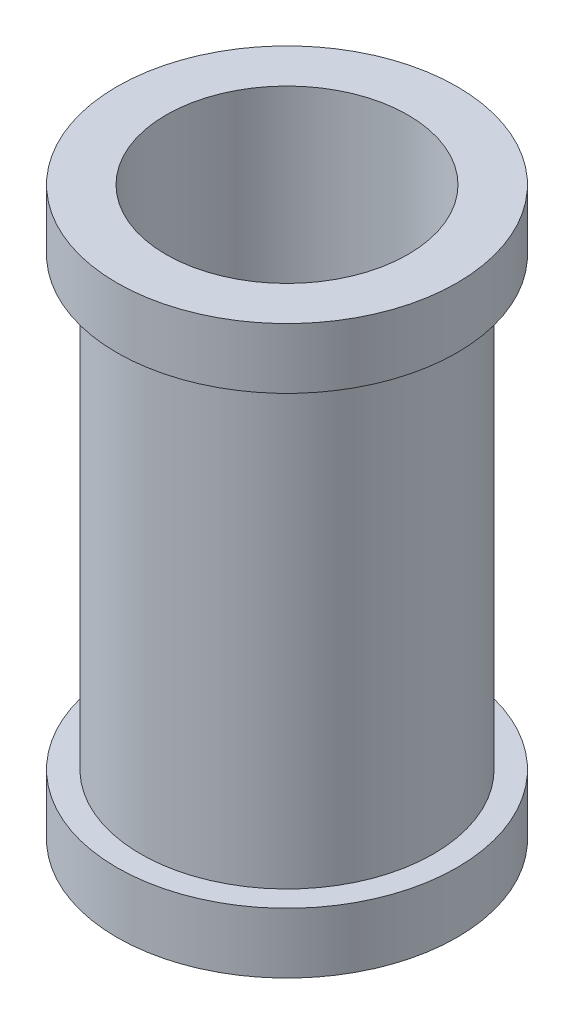
ISO-10303-21;
HEADER;
FILE_DESCRIPTION(('STEP AP214'),'2;1');
FILE_NAME('part.step','',(''),(''),'','','');
FILE_SCHEMA(('AUTOMOTIVE_DESIGN { 1 0 10303 214 1 1 1 1 }'));
ENDSEC;
DATA;
#1=APPLICATION_CONTEXT('core data for automotive mechanical design processes');
#2=APPLICATION_PROTOCOL_DEFINITION('international standard','automotive_design',2000,#1);
#3=PRODUCT_CONTEXT('',#1,'mechanical');
#4=PRODUCT('Part','Part','',(#3));
#5=PRODUCT_RELATED_PRODUCT_CATEGORY('part','',(#4));
#6=PRODUCT_DEFINITION_FORMATION('','',#4);
#7=PRODUCT_DEFINITION_CONTEXT('part definition',#1,'design');
#8=PRODUCT_DEFINITION('design','',#6,#7);
#9=PRODUCT_DEFINITION_SHAPE('','',#8);
#10=(LENGTH_UNIT() NAMED_UNIT(*) SI_UNIT(.MILLI.,.METRE.));
#11=(NAMED_UNIT(*) PLANE_ANGLE_UNIT() SI_UNIT($,.RADIAN.));
#12=(NAMED_UNIT(*) SI_UNIT($,.STERADIAN.) SOLID_ANGLE_UNIT());
#13=UNCERTAINTY_MEASURE_WITH_UNIT(LENGTH_MEASURE(1.E-05),#10,'distance_accuracy_value','');
#14=(GEOMETRIC_REPRESENTATION_CONTEXT(3) GLOBAL_UNCERTAINTY_ASSIGNED_CONTEXT((#13)) GLOBAL_UNIT_ASSIGNED_CONTEXT((#10,
#11,#12)) REPRESENTATION_CONTEXT('',''));
#15=CARTESIAN_POINT('',(0.,0.,0.));
#16=DIRECTION('',(0.,0.,1.));
#17=DIRECTION('',(1.,0.,0.));
#18=AXIS2_PLACEMENT_3D('',#15,#16,#17);
#19=CARTESIAN_POINT('',(28.575,85.09,-28.575));
#20=DIRECTION('',(0.,1.,0.));
#21=DIRECTION('',(-1.,0.,0.));
#22=AXIS2_PLACEMENT_3D('',#19,#20,#21);
#23=PLANE('',#22);
#24=CARTESIAN_POINT('',(0.,85.09,0.));
#25=DIRECTION('',(0.,1.,0.));
#26=DIRECTION('',(-1.,0.,0.));
#27=AXIS2_PLACEMENT_3D('',#24,#25,#26);
#28=CIRCLE('',#27,28.575);
#29=CARTESIAN_POINT('',(-28.575,85.09,0.));
#30=VERTEX_POINT('',#29);
#31=EDGE_CURVE('E41',#30,#30,#28,.F.);
#32=ORIENTED_EDGE('',*,*,#31,.T.);
#33=EDGE_LOOP('',(#32));
#34=FACE_BOUND('',#33,.T.);
#35=CARTESIAN_POINT('',(0.,85.09,0.));
#36=DIRECTION('',(0.,1.,0.));
#37=DIRECTION('',(-1.,0.,0.));
#38=AXIS2_PLACEMENT_3D('',#35,#36,#37);
#39=CIRCLE('',#38,24.60625);
#40=CARTESIAN_POINT('',(-24.60625,85.09,0.));
#41=VERTEX_POINT('',#40);
#42=EDGE_CURVE('E10',#41,#41,#39,.F.);
#43=ORIENTED_EDGE('',*,*,#42,.F.);
#44=EDGE_LOOP('',(#43));
#45=FACE_BOUND('',#44,.T.);
#46=ADVANCED_FACE('F34',(#34,#45),#23,.F.);
#47=CARTESIAN_POINT('',(0.,95.25,0.));
#48=DIRECTION('',(0.,-1.,0.));
#49=DIRECTION('',(0.,0.,-1.));
#50=AXIS2_PLACEMENT_3D('',#47,#48,#49);
#51=CYLINDRICAL_SURFACE('',#50,20.32);
#52=CARTESIAN_POINT('',(0.,95.25,0.));
#53=DIRECTION('',(0.,1.,0.));
#54=DIRECTION('',(0.,0.,1.));
#55=AXIS2_PLACEMENT_3D('',#52,#53,#54);
#56=CIRCLE('',#55,20.32);
#57=CARTESIAN_POINT('',(0.,95.25,20.32));
#58=VERTEX_POINT('',#57);
#59=EDGE_CURVE('E50',#58,#58,#56,.T.);
#60=ORIENTED_EDGE('',*,*,#59,.T.);
#61=EDGE_LOOP('',(#60));
#62=FACE_BOUND('',#61,.T.);
#63=CARTESIAN_POINT('',(0.,0.,0.));
#64=DIRECTION('',(0.,1.,0.));
#65=DIRECTION('',(0.,0.,1.));
#66=AXIS2_PLACEMENT_3D('',#63,#64,#65);
#67=CIRCLE('',#66,20.32);
#68=CARTESIAN_POINT('',(0.,0.,20.32));
#69=VERTEX_POINT('',#68);
#70=EDGE_CURVE('E63',#69,#69,#67,.T.);
#71=ORIENTED_EDGE('',*,*,#70,.F.);
#72=EDGE_LOOP('',(#71));
#73=FACE_BOUND('',#72,.T.);
#74=ADVANCED_FACE('F90',(#62,#73),#51,.F.);
#75=CARTESIAN_POINT('',(0.,95.25,0.));
#76=DIRECTION('',(0.,1.,0.));
#77=DIRECTION('',(0.,0.,1.));
#78=AXIS2_PLACEMENT_3D('',#75,#76,#77);
#79=PLANE('',#78);
#80=ORIENTED_EDGE('',*,*,#59,.F.);
#81=EDGE_LOOP('',(#80));
#82=FACE_BOUND('',#81,.T.);
#83=CARTESIAN_POINT('',(0.,95.25,0.));
#84=DIRECTION('',(0.,1.,0.));
#85=DIRECTION('',(0.,0.,1.));
#86=AXIS2_PLACEMENT_3D('',#83,#84,#85);
#87=CIRCLE('',#86,28.575);
#88=CARTESIAN_POINT('',(0.,95.25,28.575));
#89=VERTEX_POINT('',#88);
#90=EDGE_CURVE('E45',#89,#89,#87,.T.);
#91=ORIENTED_EDGE('',*,*,#90,.T.);
#92=EDGE_LOOP('',(#91));
#93=FACE_BOUND('',#92,.T.);
#94=ADVANCED_FACE('F95',(#82,#93),#79,.T.);
#95=CARTESIAN_POINT('',(0.,-80.8223050896224,0.));
#96=DIRECTION('',(0.,1.,0.));
#97=DIRECTION('',(0.,0.,1.));
#98=AXIS2_PLACEMENT_3D('',#95,#96,#97);
#99=CYLINDRICAL_SURFACE('',#98,28.575);
#100=ORIENTED_EDGE('',*,*,#31,.F.);
#101=EDGE_LOOP('',(#100));
#102=FACE_BOUND('',#101,.T.);
#103=ORIENTED_EDGE('',*,*,#90,.F.);
#104=EDGE_LOOP('',(#103));
#105=FACE_BOUND('',#104,.T.);
#106=ADVANCED_FACE('F36',(#102,#105),#99,.T.);
#107=CARTESIAN_POINT('',(0.,154.686984938286,0.));
#108=DIRECTION('',(0.,-1.,0.));
#109=DIRECTION('',(1.,0.,0.));
#110=AXIS2_PLACEMENT_3D('',#107,#108,#109);
#111=CYLINDRICAL_SURFACE('',#110,24.60625);
#112=CARTESIAN_POINT('',(0.,10.16,0.));
#113=DIRECTION('',(0.,1.,0.));
#114=DIRECTION('',(-1.,0.,0.));
#115=AXIS2_PLACEMENT_3D('',#112,#113,#114);
#116=CIRCLE('',#115,24.60625);
#117=CARTESIAN_POINT('',(-24.60625,10.16,0.));
#118=VERTEX_POINT('',#117);
#119=EDGE_CURVE('E53',#118,#118,#116,.T.);
#120=ORIENTED_EDGE('',*,*,#119,.T.);
#121=EDGE_LOOP('',(#120));
#122=FACE_BOUND('',#121,.T.);
#123=ORIENTED_EDGE('',*,*,#42,.T.);
#124=EDGE_LOOP('',(#123));
#125=FACE_BOUND('',#124,.T.);
#126=ADVANCED_FACE('F86',(#122,#125),#111,.T.);
#127=CARTESIAN_POINT('',(0.,0.,0.));
#128=DIRECTION('',(0.,1.,0.));
#129=DIRECTION('',(0.,0.,1.));
#130=AXIS2_PLACEMENT_3D('',#127,#128,#129);
#131=PLANE('',#130);
#132=ORIENTED_EDGE('',*,*,#70,.T.);
#133=EDGE_LOOP('',(#132));
#134=FACE_BOUND('',#133,.T.);
#135=CARTESIAN_POINT('',(0.,0.,0.));
#136=DIRECTION('',(0.,1.,0.));
#137=DIRECTION('',(0.,0.,1.));
#138=AXIS2_PLACEMENT_3D('',#135,#136,#137);
#139=CIRCLE('',#138,28.575);
#140=CARTESIAN_POINT('',(0.,0.,28.575));
#141=VERTEX_POINT('',#140);
#142=EDGE_CURVE('E67',#141,#141,#139,.F.);
#143=ORIENTED_EDGE('',*,*,#142,.T.);
#144=EDGE_LOOP('',(#143));
#145=FACE_BOUND('',#144,.T.);
#146=ADVANCED_FACE('F73',(#134,#145),#131,.F.);
#147=CARTESIAN_POINT('',(0.,-80.8223050896224,0.));
#148=DIRECTION('',(0.,1.,0.));
#149=DIRECTION('',(0.,0.,1.));
#150=AXIS2_PLACEMENT_3D('',#147,#148,#149);
#151=CYLINDRICAL_SURFACE('',#150,28.575);
#152=CARTESIAN_POINT('',(0.,10.16,0.));
#153=DIRECTION('',(0.,-1.,0.));
#154=DIRECTION('',(1.,0.,0.));
#155=AXIS2_PLACEMENT_3D('',#152,#153,#154);
#156=CIRCLE('',#155,28.575);
#157=CARTESIAN_POINT('',(28.575,10.16,0.));
#158=VERTEX_POINT('',#157);
#159=EDGE_CURVE('E59',#158,#158,#156,.F.);
#160=ORIENTED_EDGE('',*,*,#159,.F.);
#161=EDGE_LOOP('',(#160));
#162=FACE_BOUND('',#161,.T.);
#163=ORIENTED_EDGE('',*,*,#142,.F.);
#164=EDGE_LOOP('',(#163));
#165=FACE_BOUND('',#164,.T.);
#166=ADVANCED_FACE('F75',(#162,#165),#151,.T.);
#167=CARTESIAN_POINT('',(28.575,10.16,-28.575));
#168=DIRECTION('',(0.,-1.,0.));
#169=DIRECTION('',(1.,0.,0.));
#170=AXIS2_PLACEMENT_3D('',#167,#168,#169);
#171=PLANE('',#170);
#172=ORIENTED_EDGE('',*,*,#119,.F.);
#173=EDGE_LOOP('',(#172));
#174=FACE_BOUND('',#173,.T.);
#175=ORIENTED_EDGE('',*,*,#159,.T.);
#176=EDGE_LOOP('',(#175));
#177=FACE_BOUND('',#176,.T.);
#178=ADVANCED_FACE('F77',(#174,#177),#171,.F.);
#179=CLOSED_SHELL('',(#46,#74,#94,#106,#126,#146,#166,#178));
#180=MANIFOLD_SOLID_BREP('B2',#179);
#181=ADVANCED_BREP_SHAPE_REPRESENTATION('',(#18,#180),#14);
#182=SHAPE_DEFINITION_REPRESENTATION(#9,#181);
ENDSEC;
END-ISO-10303-21;
